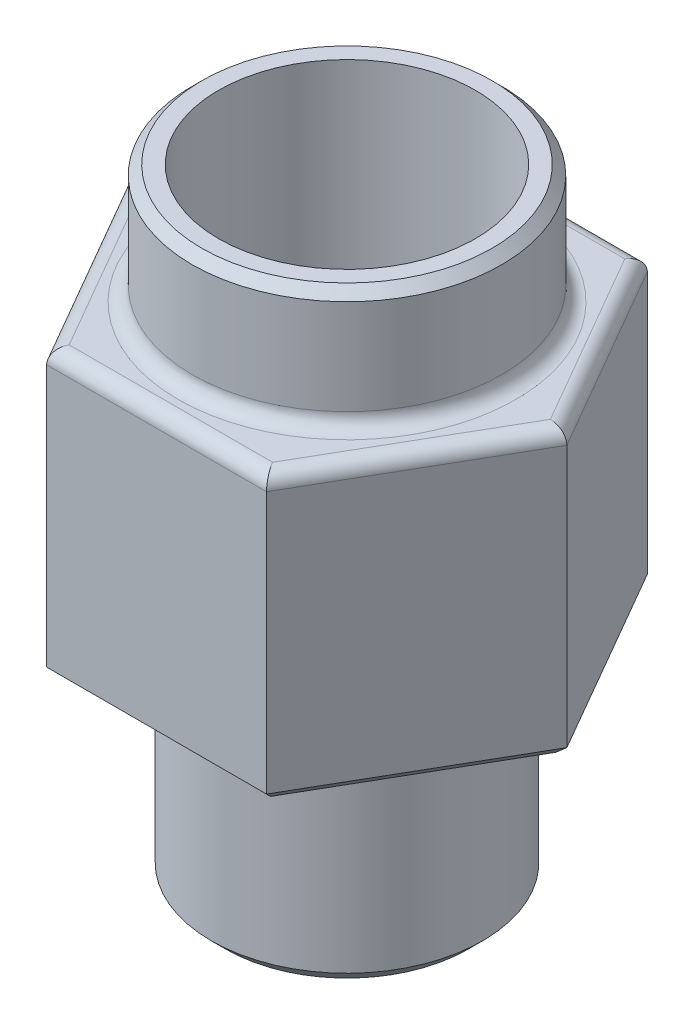
ISO-10303-21;
HEADER;
FILE_DESCRIPTION(('STEP AP214'),'2;1');
FILE_NAME('part.step','',(''),(''),'','','');
FILE_SCHEMA(('AUTOMOTIVE_DESIGN { 1 0 10303 214 1 1 1 1 }'));
ENDSEC;
DATA;
#1=APPLICATION_CONTEXT('core data for automotive mechanical design processes');
#2=APPLICATION_PROTOCOL_DEFINITION('international standard','automotive_design',2000,#1);
#3=PRODUCT_CONTEXT('',#1,'mechanical');
#4=PRODUCT('Part','Part','',(#3));
#5=PRODUCT_RELATED_PRODUCT_CATEGORY('part','',(#4));
#6=PRODUCT_DEFINITION_FORMATION('','',#4);
#7=PRODUCT_DEFINITION_CONTEXT('part definition',#1,'design');
#8=PRODUCT_DEFINITION('design','',#6,#7);
#9=PRODUCT_DEFINITION_SHAPE('','',#8);
#10=(LENGTH_UNIT() NAMED_UNIT(*) SI_UNIT(.MILLI.,.METRE.));
#11=(NAMED_UNIT(*) PLANE_ANGLE_UNIT() SI_UNIT($,.RADIAN.));
#12=(NAMED_UNIT(*) SI_UNIT($,.STERADIAN.) SOLID_ANGLE_UNIT());
#13=UNCERTAINTY_MEASURE_WITH_UNIT(LENGTH_MEASURE(1.E-05),#10,'distance_accuracy_value','');
#14=(GEOMETRIC_REPRESENTATION_CONTEXT(3) GLOBAL_UNCERTAINTY_ASSIGNED_CONTEXT((#13)) GLOBAL_UNIT_ASSIGNED_CONTEXT((#10,
#11,#12)) REPRESENTATION_CONTEXT('',''));
#15=CARTESIAN_POINT('',(0.,0.,0.));
#16=DIRECTION('',(0.,0.,1.));
#17=DIRECTION('',(1.,0.,0.));
#18=AXIS2_PLACEMENT_3D('',#15,#16,#17);
#19=CARTESIAN_POINT('',(0.,4.5,0.));
#20=DIRECTION('',(0.,-1.,0.));
#21=DIRECTION('',(0.,0.,-1.));
#22=AXIS2_PLACEMENT_3D('',#19,#20,#21);
#23=CYLINDRICAL_SURFACE('',#22,2.85);
#24=CARTESIAN_POINT('',(0.,0.299999999999999,0.));
#25=DIRECTION('',(0.,1.,0.));
#26=DIRECTION('',(0.,0.,1.));
#27=AXIS2_PLACEMENT_3D('',#24,#25,#26);
#28=CIRCLE('',#27,2.85);
#29=CARTESIAN_POINT('',(0.,0.299999999999999,2.85));
#30=VERTEX_POINT('',#29);
#31=EDGE_CURVE('E46',#30,#30,#28,.T.);
#32=ORIENTED_EDGE('',*,*,#31,.T.);
#33=EDGE_LOOP('',(#32));
#34=FACE_BOUND('',#33,.T.);
#35=CARTESIAN_POINT('',(0.,4.3,0.));
#36=DIRECTION('',(0.,1.,0.));
#37=DIRECTION('',(0.,0.,1.));
#38=AXIS2_PLACEMENT_3D('',#35,#36,#37);
#39=CIRCLE('',#38,2.85);
#40=CARTESIAN_POINT('',(0.,4.3,2.85));
#41=VERTEX_POINT('',#40);
#42=EDGE_CURVE('E186',#41,#41,#39,.F.);
#43=ORIENTED_EDGE('',*,*,#42,.T.);
#44=EDGE_LOOP('',(#43));
#45=FACE_BOUND('',#44,.T.);
#46=ADVANCED_FACE('F37',(#34,#45),#23,.T.);
#47=CARTESIAN_POINT('',(0.,0.,0.));
#48=DIRECTION('',(0.,1.,0.));
#49=DIRECTION('',(0.,0.,1.));
#50=AXIS2_PLACEMENT_3D('',#47,#48,#49);
#51=PLANE('',#50);
#52=CARTESIAN_POINT('',(0.,0.,0.));
#53=DIRECTION('',(0.,1.,0.));
#54=DIRECTION('',(0.,0.,1.));
#55=AXIS2_PLACEMENT_3D('',#52,#53,#54);
#56=CIRCLE('',#55,2.55);
#57=CARTESIAN_POINT('',(0.,0.,2.55));
#58=VERTEX_POINT('',#57);
#59=EDGE_CURVE('E11',#58,#58,#56,.F.);
#60=ORIENTED_EDGE('',*,*,#59,.T.);
#61=EDGE_LOOP('',(#60));
#62=FACE_BOUND('',#61,.T.);
#63=ADVANCED_FACE('F272',(#62),#51,.F.);
#64=CARTESIAN_POINT('',(2.3094010767585,10.5,4.));
#65=DIRECTION('',(-0.866025403784439,0.,-0.5));
#66=DIRECTION('',(-0.5,0.,0.866025403784439));
#67=AXIS2_PLACEMENT_3D('',#64,#65,#66);
#68=PLANE('',#67);
#69=DIRECTION('',(0.,-1.,0.));
#70=VECTOR('',#69,1.);
#71=CARTESIAN_POINT('',(4.618802153517,10.5,0.));
#72=LINE('',#71,#70);
#73=CARTESIAN_POINT('',(4.618802153517,10.2,0.));
#74=VERTEX_POINT('',#73);
#75=CARTESIAN_POINT('',(4.618802153517,4.7,0.));
#76=VERTEX_POINT('',#75);
#77=EDGE_CURVE('E134',#74,#76,#72,.T.);
#78=ORIENTED_EDGE('',*,*,#77,.F.);
#79=DIRECTION('',(0.5,0.,-0.866025403784439));
#80=VECTOR('',#79,1.);
#81=CARTESIAN_POINT('',(2.3094010767585,10.2,4.));
#82=LINE('',#81,#80);
#83=CARTESIAN_POINT('',(2.3094010767585,10.2,4.));
#84=VERTEX_POINT('',#83);
#85=EDGE_CURVE('E226',#74,#84,#82,.F.);
#86=ORIENTED_EDGE('',*,*,#85,.T.);
#87=DIRECTION('',(0.,-1.,0.));
#88=VECTOR('',#87,1.);
#89=CARTESIAN_POINT('',(2.3094010767585,10.5,4.));
#90=LINE('',#89,#88);
#91=CARTESIAN_POINT('',(2.3094010767585,4.7,4.));
#92=VERTEX_POINT('',#91);
#93=EDGE_CURVE('E201',#84,#92,#90,.T.);
#94=ORIENTED_EDGE('',*,*,#93,.T.);
#95=DIRECTION('',(0.5,0.,-0.866025403784439));
#96=VECTOR('',#95,1.);
#97=CARTESIAN_POINT('',(2.3094010767585,4.7,4.));
#98=LINE('',#97,#96);
#99=EDGE_CURVE('E184',#92,#76,#98,.T.);
#100=ORIENTED_EDGE('',*,*,#99,.T.);
#101=EDGE_LOOP('',(#78,#86,#94,#100));
#102=FACE_BOUND('',#101,.T.);
#103=ADVANCED_FACE('F277',(#102),#68,.F.);
#104=CARTESIAN_POINT('',(4.618802153517,10.5,0.));
#105=DIRECTION('',(-0.866025403784439,0.,0.5));
#106=DIRECTION('',(0.5,0.,0.866025403784439));
#107=AXIS2_PLACEMENT_3D('',#104,#105,#106);
#108=PLANE('',#107);
#109=DIRECTION('',(0.,-1.,0.));
#110=VECTOR('',#109,1.);
#111=CARTESIAN_POINT('',(2.3094010767585,10.5,-4.));
#112=LINE('',#111,#110);
#113=CARTESIAN_POINT('',(2.3094010767585,10.2,-4.));
#114=VERTEX_POINT('',#113);
#115=CARTESIAN_POINT('',(2.3094010767585,4.7,-4.));
#116=VERTEX_POINT('',#115);
#117=EDGE_CURVE('E126',#114,#116,#112,.T.);
#118=ORIENTED_EDGE('',*,*,#117,.F.);
#119=DIRECTION('',(-0.5,0.,-0.866025403784439));
#120=VECTOR('',#119,1.);
#121=CARTESIAN_POINT('',(4.618802153517,10.2,0.));
#122=LINE('',#121,#120);
#123=EDGE_CURVE('E53',#114,#74,#122,.F.);
#124=ORIENTED_EDGE('',*,*,#123,.T.);
#125=ORIENTED_EDGE('',*,*,#77,.T.);
#126=DIRECTION('',(-0.5,0.,-0.866025403784439));
#127=VECTOR('',#126,1.);
#128=CARTESIAN_POINT('',(4.618802153517,4.7,0.));
#129=LINE('',#128,#127);
#130=EDGE_CURVE('E143',#76,#116,#129,.T.);
#131=ORIENTED_EDGE('',*,*,#130,.T.);
#132=EDGE_LOOP('',(#118,#124,#125,#131));
#133=FACE_BOUND('',#132,.T.);
#134=ADVANCED_FACE('F157',(#133),#108,.F.);
#135=CARTESIAN_POINT('',(2.3094010767585,10.5,-4.));
#136=DIRECTION('',(0.,0.,1.));
#137=DIRECTION('',(1.,0.,0.));
#138=AXIS2_PLACEMENT_3D('',#135,#136,#137);
#139=PLANE('',#138);
#140=DIRECTION('',(0.,-1.,0.));
#141=VECTOR('',#140,1.);
#142=CARTESIAN_POINT('',(-2.3094010767585,10.5,-4.));
#143=LINE('',#142,#141);
#144=CARTESIAN_POINT('',(-2.3094010767585,10.2,-4.));
#145=VERTEX_POINT('',#144);
#146=CARTESIAN_POINT('',(-2.3094010767585,4.7,-4.));
#147=VERTEX_POINT('',#146);
#148=EDGE_CURVE('E135',#145,#147,#143,.T.);
#149=ORIENTED_EDGE('',*,*,#148,.F.);
#150=DIRECTION('',(-1.,0.,0.));
#151=VECTOR('',#150,1.);
#152=CARTESIAN_POINT('',(2.3094010767585,10.2,-4.));
#153=LINE('',#152,#151);
#154=EDGE_CURVE('E61',#145,#114,#153,.F.);
#155=ORIENTED_EDGE('',*,*,#154,.T.);
#156=ORIENTED_EDGE('',*,*,#117,.T.);
#157=DIRECTION('',(-1.,0.,0.));
#158=VECTOR('',#157,1.);
#159=CARTESIAN_POINT('',(2.3094010767585,4.7,-4.));
#160=LINE('',#159,#158);
#161=EDGE_CURVE('E130',#116,#147,#160,.T.);
#162=ORIENTED_EDGE('',*,*,#161,.T.);
#163=EDGE_LOOP('',(#149,#155,#156,#162));
#164=FACE_BOUND('',#163,.T.);
#165=ADVANCED_FACE('F128',(#164),#139,.F.);
#166=CARTESIAN_POINT('',(-2.3094010767585,10.5,-4.));
#167=DIRECTION('',(0.866025403784439,0.,0.5));
#168=DIRECTION('',(0.5,0.,-0.866025403784439));
#169=AXIS2_PLACEMENT_3D('',#166,#167,#168);
#170=PLANE('',#169);
#171=DIRECTION('',(0.,-1.,0.));
#172=VECTOR('',#171,1.);
#173=CARTESIAN_POINT('',(-4.61880215351701,10.5,0.));
#174=LINE('',#173,#172);
#175=CARTESIAN_POINT('',(-4.61880215351701,10.2,0.));
#176=VERTEX_POINT('',#175);
#177=CARTESIAN_POINT('',(-4.61880215351701,4.7,0.));
#178=VERTEX_POINT('',#177);
#179=EDGE_CURVE('E419',#176,#178,#174,.T.);
#180=ORIENTED_EDGE('',*,*,#179,.F.);
#181=DIRECTION('',(-0.5,0.,0.866025403784439));
#182=VECTOR('',#181,1.);
#183=CARTESIAN_POINT('',(-2.3094010767585,10.2,-4.));
#184=LINE('',#183,#182);
#185=EDGE_CURVE('E222',#176,#145,#184,.F.);
#186=ORIENTED_EDGE('',*,*,#185,.T.);
#187=ORIENTED_EDGE('',*,*,#148,.T.);
#188=DIRECTION('',(-0.5,0.,0.866025403784439));
#189=VECTOR('',#188,1.);
#190=CARTESIAN_POINT('',(-2.3094010767585,4.7,-4.));
#191=LINE('',#190,#189);
#192=EDGE_CURVE('E155',#147,#178,#191,.T.);
#193=ORIENTED_EDGE('',*,*,#192,.T.);
#194=EDGE_LOOP('',(#180,#186,#187,#193));
#195=FACE_BOUND('',#194,.T.);
#196=ADVANCED_FACE('F390',(#195),#170,.F.);
#197=CARTESIAN_POINT('',(-4.61880215351701,10.5,0.));
#198=DIRECTION('',(0.866025403784439,0.,-0.5));
#199=DIRECTION('',(-0.5,0.,-0.866025403784439));
#200=AXIS2_PLACEMENT_3D('',#197,#198,#199);
#201=PLANE('',#200);
#202=DIRECTION('',(0.,-1.,0.));
#203=VECTOR('',#202,1.);
#204=CARTESIAN_POINT('',(-2.3094010767585,10.5,4.));
#205=LINE('',#204,#203);
#206=CARTESIAN_POINT('',(-2.3094010767585,10.2,4.));
#207=VERTEX_POINT('',#206);
#208=CARTESIAN_POINT('',(-2.3094010767585,4.7,4.));
#209=VERTEX_POINT('',#208);
#210=EDGE_CURVE('E415',#207,#209,#205,.T.);
#211=ORIENTED_EDGE('',*,*,#210,.F.);
#212=DIRECTION('',(0.5,0.,0.866025403784439));
#213=VECTOR('',#212,1.);
#214=CARTESIAN_POINT('',(-4.61880215351701,10.2,0.));
#215=LINE('',#214,#213);
#216=EDGE_CURVE('E220',#207,#176,#215,.F.);
#217=ORIENTED_EDGE('',*,*,#216,.T.);
#218=ORIENTED_EDGE('',*,*,#179,.T.);
#219=DIRECTION('',(0.5,0.,0.866025403784439));
#220=VECTOR('',#219,1.);
#221=CARTESIAN_POINT('',(-4.61880215351701,4.7,0.));
#222=LINE('',#221,#220);
#223=EDGE_CURVE('E178',#178,#209,#222,.T.);
#224=ORIENTED_EDGE('',*,*,#223,.T.);
#225=EDGE_LOOP('',(#211,#217,#218,#224));
#226=FACE_BOUND('',#225,.T.);
#227=ADVANCED_FACE('F386',(#226),#201,.F.);
#228=CARTESIAN_POINT('',(-2.3094010767585,10.5,4.));
#229=DIRECTION('',(0.,0.,-1.));
#230=DIRECTION('',(-1.,0.,0.));
#231=AXIS2_PLACEMENT_3D('',#228,#229,#230);
#232=PLANE('',#231);
#233=ORIENTED_EDGE('',*,*,#93,.F.);
#234=DIRECTION('',(1.,0.,0.));
#235=VECTOR('',#234,1.);
#236=CARTESIAN_POINT('',(-2.3094010767585,10.2,4.));
#237=LINE('',#236,#235);
#238=EDGE_CURVE('E217',#84,#207,#237,.F.);
#239=ORIENTED_EDGE('',*,*,#238,.T.);
#240=ORIENTED_EDGE('',*,*,#210,.T.);
#241=DIRECTION('',(1.,0.,0.));
#242=VECTOR('',#241,1.);
#243=CARTESIAN_POINT('',(-2.3094010767585,4.7,4.));
#244=LINE('',#243,#242);
#245=EDGE_CURVE('E181',#209,#92,#244,.T.);
#246=ORIENTED_EDGE('',*,*,#245,.T.);
#247=EDGE_LOOP('',(#233,#239,#240,#246));
#248=FACE_BOUND('',#247,.T.);
#249=ADVANCED_FACE('F381',(#248),#232,.F.);
#250=CARTESIAN_POINT('',(0.,10.5,0.));
#251=DIRECTION('',(0.,1.,0.));
#252=DIRECTION('',(0.,0.,1.));
#253=AXIS2_PLACEMENT_3D('',#250,#251,#252);
#254=PLANE('',#253);
#255=DIRECTION('',(0.5,0.,0.866025403784439));
#256=VECTOR('',#255,1.);
#257=CARTESIAN_POINT('',(-2.04959345562317,10.5,3.85));
#258=LINE('',#257,#256);
#259=CARTESIAN_POINT('',(-4.27239199200323,10.5,0.));
#260=VERTEX_POINT('',#259);
#261=CARTESIAN_POINT('',(-2.13619599600161,10.5,3.7));
#262=VERTEX_POINT('',#261);
#263=EDGE_CURVE('E212',#260,#262,#258,.T.);
#264=ORIENTED_EDGE('',*,*,#263,.T.);
#265=DIRECTION('',(1.,0.,0.));
#266=VECTOR('',#265,1.);
#267=CARTESIAN_POINT('',(2.3094010767585,10.5,3.7));
#268=LINE('',#267,#266);
#269=CARTESIAN_POINT('',(2.13619599600162,10.5,3.7));
#270=VERTEX_POINT('',#269);
#271=EDGE_CURVE('E214',#262,#270,#268,.T.);
#272=ORIENTED_EDGE('',*,*,#271,.T.);
#273=DIRECTION('',(0.5,0.,-0.866025403784439));
#274=VECTOR('',#273,1.);
#275=CARTESIAN_POINT('',(4.35899453238167,10.5,-0.150000000000001));
#276=LINE('',#275,#274);
#277=CARTESIAN_POINT('',(4.27239199200323,10.5,0.));
#278=VERTEX_POINT('',#277);
#279=EDGE_CURVE('E204',#270,#278,#276,.T.);
#280=ORIENTED_EDGE('',*,*,#279,.T.);
#281=DIRECTION('',(-0.5,0.,-0.866025403784439));
#282=VECTOR('',#281,1.);
#283=CARTESIAN_POINT('',(2.04959345562317,10.5,-3.85));
#284=LINE('',#283,#282);
#285=CARTESIAN_POINT('',(2.13619599600161,10.5,-3.7));
#286=VERTEX_POINT('',#285);
#287=EDGE_CURVE('E206',#278,#286,#284,.T.);
#288=ORIENTED_EDGE('',*,*,#287,.T.);
#289=DIRECTION('',(-1.,0.,0.));
#290=VECTOR('',#289,1.);
#291=CARTESIAN_POINT('',(-2.3094010767585,10.5,-3.7));
#292=LINE('',#291,#290);
#293=CARTESIAN_POINT('',(-2.13619599600162,10.5,-3.7));
#294=VERTEX_POINT('',#293);
#295=EDGE_CURVE('E208',#286,#294,#292,.T.);
#296=ORIENTED_EDGE('',*,*,#295,.T.);
#297=DIRECTION('',(-0.5,0.,0.866025403784439));
#298=VECTOR('',#297,1.);
#299=CARTESIAN_POINT('',(-4.35899453238167,10.5,0.150000000000001));
#300=LINE('',#299,#298);
#301=EDGE_CURVE('E210',#294,#260,#300,.T.);
#302=ORIENTED_EDGE('',*,*,#301,.T.);
#303=EDGE_LOOP('',(#264,#272,#280,#288,#296,#302));
#304=FACE_BOUND('',#303,.T.);
#305=CARTESIAN_POINT('',(0.,10.5,0.));
#306=DIRECTION('',(0.,1.,0.));
#307=DIRECTION('',(0.,0.,1.));
#308=AXIS2_PLACEMENT_3D('',#305,#306,#307);
#309=CIRCLE('',#308,3.55);
#310=CARTESIAN_POINT('',(0.,10.5,3.55));
#311=VERTEX_POINT('',#310);
#312=EDGE_CURVE('E188',#311,#311,#309,.F.);
#313=ORIENTED_EDGE('',*,*,#312,.T.);
#314=EDGE_LOOP('',(#313));
#315=FACE_BOUND('',#314,.T.);
#316=ADVANCED_FACE('F376',(#304,#315),#254,.T.);
#317=CARTESIAN_POINT('',(0.,4.5,0.));
#318=DIRECTION('',(0.,1.,0.));
#319=DIRECTION('',(0.,0.,1.));
#320=AXIS2_PLACEMENT_3D('',#317,#318,#319);
#321=PLANE('',#320);
#322=DIRECTION('',(1.,0.,0.));
#323=VECTOR('',#322,1.);
#324=CARTESIAN_POINT('',(0.,4.5,-3.8));
#325=LINE('',#324,#323);
#326=CARTESIAN_POINT('',(-2.19393102292058,4.5,-3.8));
#327=VERTEX_POINT('',#326);
#328=CARTESIAN_POINT('',(2.19393102292058,4.5,-3.8));
#329=VERTEX_POINT('',#328);
#330=EDGE_CURVE('E173',#327,#329,#325,.T.);
#331=ORIENTED_EDGE('',*,*,#330,.T.);
#332=DIRECTION('',(0.5,0.,0.866025403784439));
#333=VECTOR('',#332,1.);
#334=CARTESIAN_POINT('',(3.29089653438086,4.5,-1.9));
#335=LINE('',#334,#333);
#336=CARTESIAN_POINT('',(4.38786204584115,4.5,0.));
#337=VERTEX_POINT('',#336);
#338=EDGE_CURVE('E145',#329,#337,#335,.T.);
#339=ORIENTED_EDGE('',*,*,#338,.T.);
#340=DIRECTION('',(-0.5,0.,0.866025403784439));
#341=VECTOR('',#340,1.);
#342=CARTESIAN_POINT('',(3.29089653438086,4.5,1.9));
#343=LINE('',#342,#341);
#344=CARTESIAN_POINT('',(2.19393102292058,4.5,3.8));
#345=VERTEX_POINT('',#344);
#346=EDGE_CURVE('E162',#337,#345,#343,.T.);
#347=ORIENTED_EDGE('',*,*,#346,.T.);
#348=DIRECTION('',(-1.,0.,0.));
#349=VECTOR('',#348,1.);
#350=CARTESIAN_POINT('',(0.,4.5,3.8));
#351=LINE('',#350,#349);
#352=CARTESIAN_POINT('',(-2.19393102292058,4.5,3.8));
#353=VERTEX_POINT('',#352);
#354=EDGE_CURVE('E167',#345,#353,#351,.T.);
#355=ORIENTED_EDGE('',*,*,#354,.T.);
#356=DIRECTION('',(-0.5,0.,-0.866025403784439));
#357=VECTOR('',#356,1.);
#358=CARTESIAN_POINT('',(-3.29089653438086,4.5,1.9));
#359=LINE('',#358,#357);
#360=CARTESIAN_POINT('',(-4.38786204584115,4.5,0.));
#361=VERTEX_POINT('',#360);
#362=EDGE_CURVE('E169',#353,#361,#359,.T.);
#363=ORIENTED_EDGE('',*,*,#362,.T.);
#364=DIRECTION('',(0.5,0.,-0.866025403784439));
#365=VECTOR('',#364,1.);
#366=CARTESIAN_POINT('',(-3.29089653438087,4.5,-1.9));
#367=LINE('',#366,#365);
#368=EDGE_CURVE('E171',#361,#327,#367,.T.);
#369=ORIENTED_EDGE('',*,*,#368,.T.);
#370=EDGE_LOOP('',(#331,#339,#347,#355,#363,#369));
#371=FACE_BOUND('',#370,.T.);
#372=CARTESIAN_POINT('',(0.,4.5,0.));
#373=DIRECTION('',(0.,1.,0.));
#374=DIRECTION('',(0.,0.,1.));
#375=AXIS2_PLACEMENT_3D('',#372,#373,#374);
#376=CIRCLE('',#375,3.05);
#377=CARTESIAN_POINT('',(0.,4.5,3.05));
#378=VERTEX_POINT('',#377);
#379=EDGE_CURVE('E159',#378,#378,#376,.T.);
#380=ORIENTED_EDGE('',*,*,#379,.T.);
#381=EDGE_LOOP('',(#380));
#382=FACE_BOUND('',#381,.T.);
#383=ADVANCED_FACE('F367',(#371,#382),#321,.F.);
#384=CARTESIAN_POINT('',(0.,13.,0.));
#385=DIRECTION('',(0.,-1.,0.));
#386=DIRECTION('',(0.,0.,-1.));
#387=AXIS2_PLACEMENT_3D('',#384,#385,#386);
#388=CYLINDRICAL_SURFACE('',#387,3.25);
#389=CARTESIAN_POINT('',(0.,12.8,0.));
#390=DIRECTION('',(0.,1.,0.));
#391=DIRECTION('',(0.,0.,1.));
#392=AXIS2_PLACEMENT_3D('',#389,#390,#391);
#393=CIRCLE('',#392,3.25);
#394=CARTESIAN_POINT('',(0.,12.8,3.25));
#395=VERTEX_POINT('',#394);
#396=EDGE_CURVE('E250',#395,#395,#393,.F.);
#397=ORIENTED_EDGE('',*,*,#396,.T.);
#398=EDGE_LOOP('',(#397));
#399=FACE_BOUND('',#398,.T.);
#400=CARTESIAN_POINT('',(0.,10.8,0.));
#401=DIRECTION('',(0.,1.,0.));
#402=DIRECTION('',(0.,0.,1.));
#403=AXIS2_PLACEMENT_3D('',#400,#401,#402);
#404=CIRCLE('',#403,3.25);
#405=CARTESIAN_POINT('',(0.,10.8,3.25));
#406=VERTEX_POINT('',#405);
#407=EDGE_CURVE('E228',#406,#406,#404,.T.);
#408=ORIENTED_EDGE('',*,*,#407,.T.);
#409=EDGE_LOOP('',(#408));
#410=FACE_BOUND('',#409,.T.);
#411=ADVANCED_FACE('F365',(#399,#410),#388,.T.);
#412=CARTESIAN_POINT('',(0.,13.,0.));
#413=DIRECTION('',(0.,1.,0.));
#414=DIRECTION('',(0.,0.,1.));
#415=AXIS2_PLACEMENT_3D('',#412,#413,#414);
#416=PLANE('',#415);
#417=CARTESIAN_POINT('',(0.,13.,0.));
#418=DIRECTION('',(0.,1.,0.));
#419=DIRECTION('',(0.,0.,1.));
#420=AXIS2_PLACEMENT_3D('',#417,#418,#419);
#421=CIRCLE('',#420,2.7);
#422=CARTESIAN_POINT('',(0.,13.,2.7));
#423=VERTEX_POINT('',#422);
#424=EDGE_CURVE('E442',#423,#423,#421,.T.);
#425=ORIENTED_EDGE('',*,*,#424,.F.);
#426=EDGE_LOOP('',(#425));
#427=FACE_BOUND('',#426,.T.);
#428=CARTESIAN_POINT('',(0.,13.,0.));
#429=DIRECTION('',(0.,1.,0.));
#430=DIRECTION('',(0.,0.,1.));
#431=AXIS2_PLACEMENT_3D('',#428,#429,#430);
#432=CIRCLE('',#431,3.04999999999999);
#433=CARTESIAN_POINT('',(0.,13.,3.04999999999999));
#434=VERTEX_POINT('',#433);
#435=EDGE_CURVE('E231',#434,#434,#432,.T.);
#436=ORIENTED_EDGE('',*,*,#435,.T.);
#437=EDGE_LOOP('',(#436));
#438=FACE_BOUND('',#437,.T.);
#439=ADVANCED_FACE('F321',(#427,#438),#416,.T.);
#440=CARTESIAN_POINT('',(-4.61880215351701,4.7,0.));
#441=DIRECTION('',(0.612372435695794,0.707106781186549,-0.353553390593273));
#442=DIRECTION('',(0.5,0.,0.866025403784439));
#443=AXIS2_PLACEMENT_3D('',#440,#441,#442);
#444=PLANE('',#443);
#445=DIRECTION('',(0.755928946018455,-0.654653670707977,0.));
#446=VECTOR('',#445,1.);
#447=CARTESIAN_POINT('',(-4.61880215351701,4.7,0.));
#448=LINE('',#447,#446);
#449=EDGE_CURVE('E195',#361,#178,#448,.F.);
#450=ORIENTED_EDGE('',*,*,#449,.F.);
#451=ORIENTED_EDGE('',*,*,#362,.F.);
#452=DIRECTION('',(0.377964473009229,-0.654653670707977,-0.654653670707977));
#453=VECTOR('',#452,1.);
#454=CARTESIAN_POINT('',(-2.3094010767585,4.7,4.));
#455=LINE('',#454,#453);
#456=EDGE_CURVE('E198',#209,#353,#455,.T.);
#457=ORIENTED_EDGE('',*,*,#456,.F.);
#458=ORIENTED_EDGE('',*,*,#223,.F.);
#459=EDGE_LOOP('',(#450,#451,#457,#458));
#460=FACE_BOUND('',#459,.T.);
#461=ADVANCED_FACE('F315',(#460),#444,.F.);
#462=CARTESIAN_POINT('',(-2.3094010767585,4.7,4.));
#463=DIRECTION('',(0.,0.707106781186547,-0.707106781186547));
#464=DIRECTION('',(1.,0.,0.));
#465=AXIS2_PLACEMENT_3D('',#462,#463,#464);
#466=PLANE('',#465);
#467=ORIENTED_EDGE('',*,*,#456,.T.);
#468=ORIENTED_EDGE('',*,*,#354,.F.);
#469=DIRECTION('',(-0.37796447300923,-0.654653670707977,-0.654653670707977));
#470=VECTOR('',#469,1.);
#471=CARTESIAN_POINT('',(2.3094010767585,4.7,4.));
#472=LINE('',#471,#470);
#473=EDGE_CURVE('E192',#92,#345,#472,.T.);
#474=ORIENTED_EDGE('',*,*,#473,.F.);
#475=ORIENTED_EDGE('',*,*,#245,.F.);
#476=EDGE_LOOP('',(#467,#468,#474,#475));
#477=FACE_BOUND('',#476,.T.);
#478=ADVANCED_FACE('F308',(#477),#466,.F.);
#479=CARTESIAN_POINT('',(-2.3094010767585,4.7,-4.));
#480=DIRECTION('',(0.612372435695795,0.707106781186548,0.353553390593274));
#481=DIRECTION('',(-0.5,0.,0.866025403784439));
#482=AXIS2_PLACEMENT_3D('',#479,#480,#481);
#483=PLANE('',#482);
#484=ORIENTED_EDGE('',*,*,#449,.T.);
#485=ORIENTED_EDGE('',*,*,#192,.F.);
#486=DIRECTION('',(0.377964473009228,-0.654653670707977,0.654653670707977));
#487=VECTOR('',#486,1.);
#488=CARTESIAN_POINT('',(-2.3094010767585,4.7,-4.));
#489=LINE('',#488,#487);
#490=EDGE_CURVE('E154',#327,#147,#489,.F.);
#491=ORIENTED_EDGE('',*,*,#490,.F.);
#492=ORIENTED_EDGE('',*,*,#368,.F.);
#493=EDGE_LOOP('',(#484,#485,#491,#492));
#494=FACE_BOUND('',#493,.T.);
#495=ADVANCED_FACE('F301',(#494),#483,.F.);
#496=CARTESIAN_POINT('',(2.3094010767585,4.7,4.));
#497=DIRECTION('',(-0.612372435695794,0.707106781186549,-0.353553390593273));
#498=DIRECTION('',(0.5,0.,-0.866025403784439));
#499=AXIS2_PLACEMENT_3D('',#496,#497,#498);
#500=PLANE('',#499);
#501=ORIENTED_EDGE('',*,*,#473,.T.);
#502=ORIENTED_EDGE('',*,*,#346,.F.);
#503=DIRECTION('',(0.755928946018455,0.654653670707976,0.));
#504=VECTOR('',#503,1.);
#505=CARTESIAN_POINT('',(3.29914439536929,3.55714285714286,0.));
#506=LINE('',#505,#504);
#507=EDGE_CURVE('E148',#76,#337,#506,.F.);
#508=ORIENTED_EDGE('',*,*,#507,.F.);
#509=ORIENTED_EDGE('',*,*,#99,.F.);
#510=EDGE_LOOP('',(#501,#502,#508,#509));
#511=FACE_BOUND('',#510,.T.);
#512=ADVANCED_FACE('F295',(#511),#500,.F.);
#513=CARTESIAN_POINT('',(2.3094010767585,4.7,-4.));
#514=DIRECTION('',(0.,0.707106781186547,0.707106781186547));
#515=DIRECTION('',(-1.,0.,0.));
#516=AXIS2_PLACEMENT_3D('',#513,#514,#515);
#517=PLANE('',#516);
#518=ORIENTED_EDGE('',*,*,#490,.T.);
#519=ORIENTED_EDGE('',*,*,#161,.F.);
#520=DIRECTION('',(-0.377964473009228,-0.654653670707977,0.654653670707977));
#521=VECTOR('',#520,1.);
#522=CARTESIAN_POINT('',(2.3094010767585,4.7,-4.));
#523=LINE('',#522,#521);
#524=EDGE_CURVE('E141',#329,#116,#523,.F.);
#525=ORIENTED_EDGE('',*,*,#524,.F.);
#526=ORIENTED_EDGE('',*,*,#330,.F.);
#527=EDGE_LOOP('',(#518,#519,#525,#526));
#528=FACE_BOUND('',#527,.T.);
#529=ADVANCED_FACE('F152',(#528),#517,.F.);
#530=CARTESIAN_POINT('',(4.618802153517,4.7,0.));
#531=DIRECTION('',(-0.612372435695794,0.707106781186548,0.353553390593274));
#532=DIRECTION('',(-0.5,0.,-0.866025403784439));
#533=AXIS2_PLACEMENT_3D('',#530,#531,#532);
#534=PLANE('',#533);
#535=ORIENTED_EDGE('',*,*,#507,.T.);
#536=ORIENTED_EDGE('',*,*,#338,.F.);
#537=ORIENTED_EDGE('',*,*,#524,.T.);
#538=ORIENTED_EDGE('',*,*,#130,.F.);
#539=EDGE_LOOP('',(#535,#536,#537,#538));
#540=FACE_BOUND('',#539,.T.);
#541=ADVANCED_FACE('F142',(#540),#534,.F.);
#542=CARTESIAN_POINT('',(0.,4.5,0.));
#543=DIRECTION('',(0.,1.,0.));
#544=DIRECTION('',(0.,0.,1.));
#545=AXIS2_PLACEMENT_3D('',#542,#543,#544);
#546=CONICAL_SURFACE('',#545,3.05,0.785398163397457);
#547=ORIENTED_EDGE('',*,*,#42,.F.);
#548=EDGE_LOOP('',(#547));
#549=FACE_BOUND('',#548,.T.);
#550=ORIENTED_EDGE('',*,*,#379,.F.);
#551=EDGE_LOOP('',(#550));
#552=FACE_BOUND('',#551,.T.);
#553=ADVANCED_FACE('F289',(#549,#552),#546,.T.);
#554=CARTESIAN_POINT('',(0.,10.2,-3.7));
#555=DIRECTION('',(1.,0.,0.));
#556=DIRECTION('',(0.,0.,-1.));
#557=AXIS2_PLACEMENT_3D('',#554,#555,#556);
#558=CYLINDRICAL_SURFACE('',#557,0.3);
#559=CARTESIAN_POINT('',(2.13619599600161,10.2,-3.7));
#560=DIRECTION('',(0.866025403784439,0.,0.5));
#561=DIRECTION('',(-0.5,0.,0.866025403784439));
#562=AXIS2_PLACEMENT_3D('',#559,#560,#561);
#563=ELLIPSE('',#562,0.346410161513775,0.3);
#564=EDGE_CURVE('E243',#114,#286,#563,.T.);
#565=ORIENTED_EDGE('',*,*,#564,.F.);
#566=ORIENTED_EDGE('',*,*,#154,.F.);
#567=CARTESIAN_POINT('',(-2.13619599600161,10.2,-3.7));
#568=DIRECTION('',(0.866025403784439,0.,-0.5));
#569=DIRECTION('',(0.5,0.,0.866025403784439));
#570=AXIS2_PLACEMENT_3D('',#567,#568,#569);
#571=ELLIPSE('',#570,0.346410161513775,0.3);
#572=EDGE_CURVE('E149',#294,#145,#571,.F.);
#573=ORIENTED_EDGE('',*,*,#572,.F.);
#574=ORIENTED_EDGE('',*,*,#295,.F.);
#575=EDGE_LOOP('',(#565,#566,#573,#574));
#576=FACE_BOUND('',#575,.T.);
#577=ADVANCED_FACE('F328',(#576),#558,.T.);
#578=CARTESIAN_POINT('',(-3.20429399400242,10.2,-1.85));
#579=DIRECTION('',(0.5,0.,-0.866025403784439));
#580=DIRECTION('',(-0.866025403784439,0.,-0.5));
#581=AXIS2_PLACEMENT_3D('',#578,#579,#580);
#582=CYLINDRICAL_SURFACE('',#581,0.3);
#583=ORIENTED_EDGE('',*,*,#572,.T.);
#584=ORIENTED_EDGE('',*,*,#185,.F.);
#585=CARTESIAN_POINT('',(-4.27239199200323,10.2,0.));
#586=DIRECTION('',(0.,0.,-1.));
#587=DIRECTION('',(1.,0.,0.));
#588=AXIS2_PLACEMENT_3D('',#585,#586,#587);
#589=ELLIPSE('',#588,0.346410161513775,0.3);
#590=EDGE_CURVE('E240',#260,#176,#589,.F.);
#591=ORIENTED_EDGE('',*,*,#590,.F.);
#592=ORIENTED_EDGE('',*,*,#301,.F.);
#593=EDGE_LOOP('',(#583,#584,#591,#592));
#594=FACE_BOUND('',#593,.T.);
#595=ADVANCED_FACE('F345',(#594),#582,.T.);
#596=CARTESIAN_POINT('',(3.20429399400242,10.2,-1.85));
#597=DIRECTION('',(0.5,0.,0.866025403784439));
#598=DIRECTION('',(0.866025403784439,0.,-0.5));
#599=AXIS2_PLACEMENT_3D('',#596,#597,#598);
#600=CYLINDRICAL_SURFACE('',#599,0.3);
#601=ORIENTED_EDGE('',*,*,#564,.T.);
#602=ORIENTED_EDGE('',*,*,#287,.F.);
#603=CARTESIAN_POINT('',(4.27239199200323,10.2,0.));
#604=DIRECTION('',(0.,0.,1.));
#605=DIRECTION('',(-1.,0.,0.));
#606=AXIS2_PLACEMENT_3D('',#603,#604,#605);
#607=ELLIPSE('',#606,0.346410161513775,0.3);
#608=EDGE_CURVE('E237',#74,#278,#607,.T.);
#609=ORIENTED_EDGE('',*,*,#608,.F.);
#610=ORIENTED_EDGE('',*,*,#123,.F.);
#611=EDGE_LOOP('',(#601,#602,#609,#610));
#612=FACE_BOUND('',#611,.T.);
#613=ADVANCED_FACE('F341',(#612),#600,.T.);
#614=CARTESIAN_POINT('',(-3.20429399400242,10.2,1.85));
#615=DIRECTION('',(-0.5,0.,-0.866025403784439));
#616=DIRECTION('',(-0.866025403784439,0.,0.5));
#617=AXIS2_PLACEMENT_3D('',#614,#615,#616);
#618=CYLINDRICAL_SURFACE('',#617,0.3);
#619=ORIENTED_EDGE('',*,*,#590,.T.);
#620=ORIENTED_EDGE('',*,*,#216,.F.);
#621=CARTESIAN_POINT('',(-2.13619599600161,10.2,3.7));
#622=DIRECTION('',(-0.866025403784439,0.,-0.5));
#623=DIRECTION('',(0.5,0.,-0.866025403784439));
#624=AXIS2_PLACEMENT_3D('',#621,#622,#623);
#625=ELLIPSE('',#624,0.346410161513775,0.3);
#626=EDGE_CURVE('E234',#262,#207,#625,.F.);
#627=ORIENTED_EDGE('',*,*,#626,.F.);
#628=ORIENTED_EDGE('',*,*,#263,.F.);
#629=EDGE_LOOP('',(#619,#620,#627,#628));
#630=FACE_BOUND('',#629,.T.);
#631=ADVANCED_FACE('F337',(#630),#618,.T.);
#632=CARTESIAN_POINT('',(3.20429399400242,10.2,1.85));
#633=DIRECTION('',(-0.5,0.,0.866025403784439));
#634=DIRECTION('',(0.866025403784439,0.,0.5));
#635=AXIS2_PLACEMENT_3D('',#632,#633,#634);
#636=CYLINDRICAL_SURFACE('',#635,0.3);
#637=ORIENTED_EDGE('',*,*,#608,.T.);
#638=ORIENTED_EDGE('',*,*,#279,.F.);
#639=CARTESIAN_POINT('',(2.13619599600161,10.2,3.7));
#640=DIRECTION('',(-0.866025403784438,0.,0.5));
#641=DIRECTION('',(0.5,0.,0.866025403784438));
#642=AXIS2_PLACEMENT_3D('',#639,#640,#641);
#643=ELLIPSE('',#642,0.346410161513776,0.3);
#644=EDGE_CURVE('E232',#84,#270,#643,.T.);
#645=ORIENTED_EDGE('',*,*,#644,.F.);
#646=ORIENTED_EDGE('',*,*,#85,.F.);
#647=EDGE_LOOP('',(#637,#638,#645,#646));
#648=FACE_BOUND('',#647,.T.);
#649=ADVANCED_FACE('F333',(#648),#636,.T.);
#650=CARTESIAN_POINT('',(0.,10.2,3.7));
#651=DIRECTION('',(-1.,0.,0.));
#652=DIRECTION('',(0.,0.,1.));
#653=AXIS2_PLACEMENT_3D('',#650,#651,#652);
#654=CYLINDRICAL_SURFACE('',#653,0.3);
#655=ORIENTED_EDGE('',*,*,#626,.T.);
#656=ORIENTED_EDGE('',*,*,#238,.F.);
#657=ORIENTED_EDGE('',*,*,#644,.T.);
#658=ORIENTED_EDGE('',*,*,#271,.F.);
#659=EDGE_LOOP('',(#655,#656,#657,#658));
#660=FACE_BOUND('',#659,.T.);
#661=ADVANCED_FACE('F330',(#660),#654,.T.);
#662=CARTESIAN_POINT('',(0.,10.8,0.));
#663=DIRECTION('',(0.,1.,0.));
#664=DIRECTION('',(0.,0.,1.));
#665=AXIS2_PLACEMENT_3D('',#662,#663,#664);
#666=TOROIDAL_SURFACE('',#665,3.55,0.3);
#667=ORIENTED_EDGE('',*,*,#312,.F.);
#668=EDGE_LOOP('',(#667));
#669=FACE_BOUND('',#668,.T.);
#670=ORIENTED_EDGE('',*,*,#407,.F.);
#671=EDGE_LOOP('',(#670));
#672=FACE_BOUND('',#671,.T.);
#673=ADVANCED_FACE('F268',(#669,#672),#666,.F.);
#674=CARTESIAN_POINT('',(0.,13.,0.));
#675=DIRECTION('',(0.,-1.,0.));
#676=DIRECTION('',(0.,0.,-1.));
#677=AXIS2_PLACEMENT_3D('',#674,#675,#676);
#678=CONICAL_SURFACE('',#677,3.04999999999999,0.785398163397455);
#679=ORIENTED_EDGE('',*,*,#396,.F.);
#680=EDGE_LOOP('',(#679));
#681=FACE_BOUND('',#680,.T.);
#682=ORIENTED_EDGE('',*,*,#435,.F.);
#683=EDGE_LOOP('',(#682));
#684=FACE_BOUND('',#683,.T.);
#685=ADVANCED_FACE('F259',(#681,#684),#678,.T.);
#686=CARTESIAN_POINT('',(0.,0.299999999999999,0.));
#687=DIRECTION('',(0.,1.,0.));
#688=DIRECTION('',(0.,0.,1.));
#689=AXIS2_PLACEMENT_3D('',#686,#687,#688);
#690=CONICAL_SURFACE('',#689,2.85,0.785398163397449);
#691=ORIENTED_EDGE('',*,*,#59,.F.);
#692=EDGE_LOOP('',(#691));
#693=FACE_BOUND('',#692,.T.);
#694=ORIENTED_EDGE('',*,*,#31,.F.);
#695=EDGE_LOOP('',(#694));
#696=FACE_BOUND('',#695,.T.);
#697=ADVANCED_FACE('F40',(#693,#696),#690,.T.);
#698=CARTESIAN_POINT('',(0.,8.,0.));
#699=DIRECTION('',(0.,1.,0.));
#700=DIRECTION('',(0.,0.,1.));
#701=AXIS2_PLACEMENT_3D('',#698,#699,#700);
#702=CYLINDRICAL_SURFACE('',#701,2.7);
#703=CARTESIAN_POINT('',(0.,8.,0.));
#704=DIRECTION('',(0.,1.,0.));
#705=DIRECTION('',(0.,0.,1.));
#706=AXIS2_PLACEMENT_3D('',#703,#704,#705);
#707=CIRCLE('',#706,2.7);
#708=CARTESIAN_POINT('',(0.,8.,2.7));
#709=VERTEX_POINT('',#708);
#710=EDGE_CURVE('E235',#709,#709,#707,.T.);
#711=ORIENTED_EDGE('',*,*,#710,.F.);
#712=EDGE_LOOP('',(#711));
#713=FACE_BOUND('',#712,.T.);
#714=ORIENTED_EDGE('',*,*,#424,.T.);
#715=EDGE_LOOP('',(#714));
#716=FACE_BOUND('',#715,.T.);
#717=ADVANCED_FACE('F258',(#713,#716),#702,.F.);
#718=CARTESIAN_POINT('',(0.,8.,0.));
#719=DIRECTION('',(0.,1.,0.));
#720=DIRECTION('',(0.,0.,1.));
#721=AXIS2_PLACEMENT_3D('',#718,#719,#720);
#722=PLANE('',#721);
#723=ORIENTED_EDGE('',*,*,#710,.T.);
#724=EDGE_LOOP('',(#723));
#725=FACE_BOUND('',#724,.T.);
#726=ADVANCED_FACE('F265',(#725),#722,.T.);
#727=CLOSED_SHELL('',(#46,#63,#103,#134,#165,#196,#227,#249,#316,#383,#411,#439,#461,#478,#495,
#512,#529,#541,#553,#577,#595,#613,#631,#649,#661,#673,#685,#697,#717,#726));
#728=MANIFOLD_SOLID_BREP('B2',#727);
#729=ADVANCED_BREP_SHAPE_REPRESENTATION('',(#18,#728),#14);
#730=SHAPE_DEFINITION_REPRESENTATION(#9,#729);
ENDSEC;
END-ISO-10303-21;
